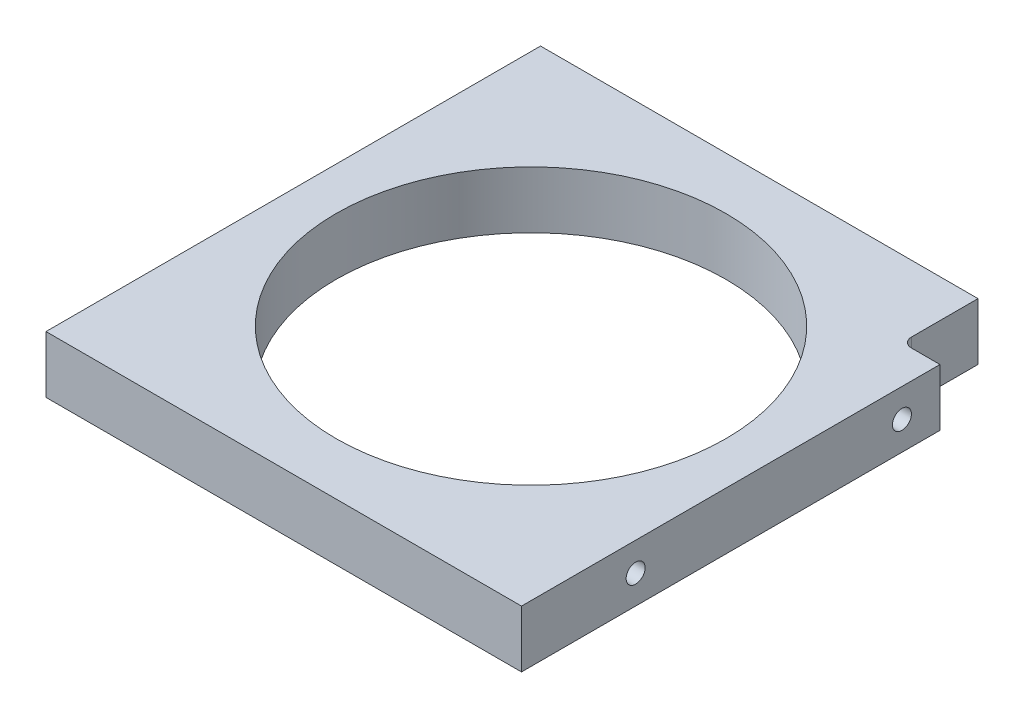
ISO-10303-21;
HEADER;
FILE_DESCRIPTION(('STEP AP214'),'2;1');
FILE_NAME('part.step','',(''),(''),'','','');
FILE_SCHEMA(('AUTOMOTIVE_DESIGN { 1 0 10303 214 1 1 1 1 }'));
ENDSEC;
DATA;
#1=APPLICATION_CONTEXT('core data for automotive mechanical design processes');
#2=APPLICATION_PROTOCOL_DEFINITION('international standard','automotive_design',2000,#1);
#3=PRODUCT_CONTEXT('',#1,'mechanical');
#4=PRODUCT('Part','Part','',(#3));
#5=PRODUCT_RELATED_PRODUCT_CATEGORY('part','',(#4));
#6=PRODUCT_DEFINITION_FORMATION('','',#4);
#7=PRODUCT_DEFINITION_CONTEXT('part definition',#1,'design');
#8=PRODUCT_DEFINITION('design','',#6,#7);
#9=PRODUCT_DEFINITION_SHAPE('','',#8);
#10=(LENGTH_UNIT() NAMED_UNIT(*) SI_UNIT(.MILLI.,.METRE.));
#11=(NAMED_UNIT(*) PLANE_ANGLE_UNIT() SI_UNIT($,.RADIAN.));
#12=(NAMED_UNIT(*) SI_UNIT($,.STERADIAN.) SOLID_ANGLE_UNIT());
#13=UNCERTAINTY_MEASURE_WITH_UNIT(LENGTH_MEASURE(1.E-05),#10,'distance_accuracy_value','');
#14=(GEOMETRIC_REPRESENTATION_CONTEXT(3) GLOBAL_UNCERTAINTY_ASSIGNED_CONTEXT((#13)) GLOBAL_UNIT_ASSIGNED_CONTEXT((#10,
#11,#12)) REPRESENTATION_CONTEXT('',''));
#15=CARTESIAN_POINT('',(0.,0.,0.));
#16=DIRECTION('',(0.,0.,1.));
#17=DIRECTION('',(1.,0.,0.));
#18=AXIS2_PLACEMENT_3D('',#15,#16,#17);
#19=CARTESIAN_POINT('',(0.,4.7625,0.));
#20=DIRECTION('',(0.,1.,0.));
#21=DIRECTION('',(0.,0.,1.));
#22=AXIS2_PLACEMENT_3D('',#19,#20,#21);
#23=PLANE('',#22);
#24=CARTESIAN_POINT('',(0.,4.7625,0.));
#25=DIRECTION('',(0.,1.,0.));
#26=DIRECTION('',(0.,0.,1.));
#27=AXIS2_PLACEMENT_3D('',#24,#25,#26);
#28=CIRCLE('',#27,32.54375);
#29=CARTESIAN_POINT('',(0.,4.7625,32.54375));
#30=VERTEX_POINT('',#29);
#31=EDGE_CURVE('E170',#30,#30,#28,.T.);
#32=ORIENTED_EDGE('',*,*,#31,.F.);
#33=EDGE_LOOP('',(#32));
#34=FACE_BOUND('',#33,.T.);
#35=DIRECTION('',(0.,0.,-1.));
#36=VECTOR('',#35,1.);
#37=CARTESIAN_POINT('',(39.6875,4.7625,41.275));
#38=LINE('',#37,#36);
#39=CARTESIAN_POINT('',(39.6875,4.7625,41.275));
#40=VERTEX_POINT('',#39);
#41=CARTESIAN_POINT('',(39.6875,4.7625,-28.575));
#42=VERTEX_POINT('',#41);
#43=EDGE_CURVE('E139',#40,#42,#38,.T.);
#44=ORIENTED_EDGE('',*,*,#43,.T.);
#45=DIRECTION('',(-1.,0.,0.));
#46=VECTOR('',#45,1.);
#47=CARTESIAN_POINT('',(39.6875,4.7625,-28.575));
#48=LINE('',#47,#46);
#49=CARTESIAN_POINT('',(34.925,4.7625,-28.575));
#50=VERTEX_POINT('',#49);
#51=EDGE_CURVE('E99',#42,#50,#48,.T.);
#52=ORIENTED_EDGE('',*,*,#51,.T.);
#53=CARTESIAN_POINT('',(34.925,4.7625,-30.1625));
#54=DIRECTION('',(0.,1.,0.));
#55=DIRECTION('',(0.,0.,1.));
#56=AXIS2_PLACEMENT_3D('',#53,#54,#55);
#57=CIRCLE('',#56,1.5875);
#58=CARTESIAN_POINT('',(33.3375,4.7625,-30.1625));
#59=VERTEX_POINT('',#58);
#60=EDGE_CURVE('E44',#50,#59,#57,.F.);
#61=ORIENTED_EDGE('',*,*,#60,.T.);
#62=DIRECTION('',(0.,0.,-1.));
#63=VECTOR('',#62,1.);
#64=CARTESIAN_POINT('',(33.3375,4.7625,-41.275));
#65=LINE('',#64,#63);
#66=CARTESIAN_POINT('',(33.3375,4.7625,-41.275));
#67=VERTEX_POINT('',#66);
#68=EDGE_CURVE('E113',#59,#67,#65,.T.);
#69=ORIENTED_EDGE('',*,*,#68,.T.);
#70=DIRECTION('',(-1.,0.,0.));
#71=VECTOR('',#70,1.);
#72=CARTESIAN_POINT('',(39.6875,4.7625,-41.275));
#73=LINE('',#72,#71);
#74=CARTESIAN_POINT('',(-39.6875,4.7625,-41.275));
#75=VERTEX_POINT('',#74);
#76=EDGE_CURVE('E131',#67,#75,#73,.T.);
#77=ORIENTED_EDGE('',*,*,#76,.T.);
#78=DIRECTION('',(0.,0.,1.));
#79=VECTOR('',#78,1.);
#80=CARTESIAN_POINT('',(-39.6875,4.7625,41.275));
#81=LINE('',#80,#79);
#82=CARTESIAN_POINT('',(-39.6875,4.7625,41.275));
#83=VERTEX_POINT('',#82);
#84=EDGE_CURVE('E122',#75,#83,#81,.T.);
#85=ORIENTED_EDGE('',*,*,#84,.T.);
#86=DIRECTION('',(1.,0.,0.));
#87=VECTOR('',#86,1.);
#88=CARTESIAN_POINT('',(39.6875,4.7625,41.275));
#89=LINE('',#88,#87);
#90=EDGE_CURVE('E177',#83,#40,#89,.T.);
#91=ORIENTED_EDGE('',*,*,#90,.T.);
#92=EDGE_LOOP('',(#44,#52,#61,#69,#77,#85,#91));
#93=FACE_BOUND('',#92,.T.);
#94=ADVANCED_FACE('F36',(#34,#93),#23,.T.);
#95=CARTESIAN_POINT('',(0.,-4.7625,0.));
#96=DIRECTION('',(0.,1.,0.));
#97=DIRECTION('',(0.,0.,1.));
#98=AXIS2_PLACEMENT_3D('',#95,#96,#97);
#99=PLANE('',#98);
#100=CARTESIAN_POINT('',(0.,-4.7625,0.));
#101=DIRECTION('',(0.,1.,0.));
#102=DIRECTION('',(0.,0.,1.));
#103=AXIS2_PLACEMENT_3D('',#100,#101,#102);
#104=CIRCLE('',#103,32.54375);
#105=CARTESIAN_POINT('',(0.,-4.7625,32.54375));
#106=VERTEX_POINT('',#105);
#107=EDGE_CURVE('E167',#106,#106,#104,.T.);
#108=ORIENTED_EDGE('',*,*,#107,.T.);
#109=EDGE_LOOP('',(#108));
#110=FACE_BOUND('',#109,.T.);
#111=DIRECTION('',(-1.,0.,0.));
#112=VECTOR('',#111,1.);
#113=CARTESIAN_POINT('',(39.6875,-4.7625,-28.575));
#114=LINE('',#113,#112);
#115=CARTESIAN_POINT('',(39.6875,-4.7625,-28.575));
#116=VERTEX_POINT('',#115);
#117=CARTESIAN_POINT('',(34.925,-4.7625,-28.575));
#118=VERTEX_POINT('',#117);
#119=EDGE_CURVE('E97',#116,#118,#114,.T.);
#120=ORIENTED_EDGE('',*,*,#119,.F.);
#121=DIRECTION('',(0.,0.,-1.));
#122=VECTOR('',#121,1.);
#123=CARTESIAN_POINT('',(39.6875,-4.7625,41.275));
#124=LINE('',#123,#122);
#125=CARTESIAN_POINT('',(39.6875,-4.7625,41.275));
#126=VERTEX_POINT('',#125);
#127=EDGE_CURVE('E110',#126,#116,#124,.T.);
#128=ORIENTED_EDGE('',*,*,#127,.F.);
#129=DIRECTION('',(1.,0.,0.));
#130=VECTOR('',#129,1.);
#131=CARTESIAN_POINT('',(39.6875,-4.7625,41.275));
#132=LINE('',#131,#130);
#133=CARTESIAN_POINT('',(-39.6875,-4.7625,41.275));
#134=VERTEX_POINT('',#133);
#135=EDGE_CURVE('E120',#134,#126,#132,.T.);
#136=ORIENTED_EDGE('',*,*,#135,.F.);
#137=DIRECTION('',(0.,0.,1.));
#138=VECTOR('',#137,1.);
#139=CARTESIAN_POINT('',(-39.6875,-4.7625,41.275));
#140=LINE('',#139,#138);
#141=CARTESIAN_POINT('',(-39.6875,-4.7625,-41.275));
#142=VERTEX_POINT('',#141);
#143=EDGE_CURVE('E124',#142,#134,#140,.T.);
#144=ORIENTED_EDGE('',*,*,#143,.F.);
#145=DIRECTION('',(-1.,0.,0.));
#146=VECTOR('',#145,1.);
#147=CARTESIAN_POINT('',(39.6875,-4.7625,-41.275));
#148=LINE('',#147,#146);
#149=CARTESIAN_POINT('',(33.3375,-4.7625,-41.275));
#150=VERTEX_POINT('',#149);
#151=EDGE_CURVE('E119',#150,#142,#148,.T.);
#152=ORIENTED_EDGE('',*,*,#151,.F.);
#153=DIRECTION('',(0.,0.,-1.));
#154=VECTOR('',#153,1.);
#155=CARTESIAN_POINT('',(33.3375,-4.7625,-41.275));
#156=LINE('',#155,#154);
#157=CARTESIAN_POINT('',(33.3375,-4.7625,-30.1625));
#158=VERTEX_POINT('',#157);
#159=EDGE_CURVE('E112',#158,#150,#156,.T.);
#160=ORIENTED_EDGE('',*,*,#159,.F.);
#161=CARTESIAN_POINT('',(34.925,-4.7625,-30.1625));
#162=DIRECTION('',(0.,1.,0.));
#163=DIRECTION('',(0.,0.,1.));
#164=AXIS2_PLACEMENT_3D('',#161,#162,#163);
#165=CIRCLE('',#164,1.5875);
#166=EDGE_CURVE('E11',#158,#118,#165,.T.);
#167=ORIENTED_EDGE('',*,*,#166,.T.);
#168=EDGE_LOOP('',(#120,#128,#136,#144,#152,#160,#167));
#169=FACE_BOUND('',#168,.T.);
#170=ADVANCED_FACE('F109',(#110,#169),#99,.F.);
#171=CARTESIAN_POINT('',(39.6875,4.7625,41.275));
#172=DIRECTION('',(-1.,0.,0.));
#173=DIRECTION('',(0.,0.,1.));
#174=AXIS2_PLACEMENT_3D('',#171,#172,#173);
#175=PLANE('',#174);
#176=CARTESIAN_POINT('',(39.6875,0.,-22.225));
#177=DIRECTION('',(-1.,0.,0.));
#178=DIRECTION('',(0.,0.,1.));
#179=AXIS2_PLACEMENT_3D('',#176,#177,#178);
#180=CIRCLE('',#179,1.5875);
#181=CARTESIAN_POINT('',(39.6875,0.,-20.6375));
#182=VERTEX_POINT('',#181);
#183=EDGE_CURVE('E149',#182,#182,#180,.T.);
#184=ORIENTED_EDGE('',*,*,#183,.T.);
#185=EDGE_LOOP('',(#184));
#186=FACE_BOUND('',#185,.T.);
#187=CARTESIAN_POINT('',(39.6875,0.,22.225));
#188=DIRECTION('',(-1.,0.,0.));
#189=DIRECTION('',(0.,0.,1.));
#190=AXIS2_PLACEMENT_3D('',#187,#188,#189);
#191=CIRCLE('',#190,1.5875);
#192=CARTESIAN_POINT('',(39.6875,0.,23.8125));
#193=VERTEX_POINT('',#192);
#194=EDGE_CURVE('E104',#193,#193,#191,.T.);
#195=ORIENTED_EDGE('',*,*,#194,.T.);
#196=EDGE_LOOP('',(#195));
#197=FACE_BOUND('',#196,.T.);
#198=DIRECTION('',(0.,1.,0.));
#199=VECTOR('',#198,1.);
#200=CARTESIAN_POINT('',(39.6875,-4.7625,-28.575));
#201=LINE('',#200,#199);
#202=EDGE_CURVE('E93',#116,#42,#201,.T.);
#203=ORIENTED_EDGE('',*,*,#202,.T.);
#204=ORIENTED_EDGE('',*,*,#43,.F.);
#205=DIRECTION('',(0.,-1.,0.));
#206=VECTOR('',#205,1.);
#207=CARTESIAN_POINT('',(39.6875,4.7625,41.275));
#208=LINE('',#207,#206);
#209=EDGE_CURVE('E118',#40,#126,#208,.T.);
#210=ORIENTED_EDGE('',*,*,#209,.T.);
#211=ORIENTED_EDGE('',*,*,#127,.T.);
#212=EDGE_LOOP('',(#203,#204,#210,#211));
#213=FACE_BOUND('',#212,.T.);
#214=ADVANCED_FACE('F116',(#186,#197,#213),#175,.F.);
#215=CARTESIAN_POINT('',(39.6875,4.7625,-41.275));
#216=DIRECTION('',(0.,0.,1.));
#217=DIRECTION('',(1.,0.,0.));
#218=AXIS2_PLACEMENT_3D('',#215,#216,#217);
#219=PLANE('',#218);
#220=DIRECTION('',(0.,1.,0.));
#221=VECTOR('',#220,1.);
#222=CARTESIAN_POINT('',(33.3375,-4.7625,-41.275));
#223=LINE('',#222,#221);
#224=EDGE_CURVE('E105',#150,#67,#223,.T.);
#225=ORIENTED_EDGE('',*,*,#224,.F.);
#226=ORIENTED_EDGE('',*,*,#151,.T.);
#227=DIRECTION('',(0.,-1.,0.));
#228=VECTOR('',#227,1.);
#229=CARTESIAN_POINT('',(-39.6875,4.7625,-41.275));
#230=LINE('',#229,#228);
#231=EDGE_CURVE('E128',#75,#142,#230,.T.);
#232=ORIENTED_EDGE('',*,*,#231,.F.);
#233=ORIENTED_EDGE('',*,*,#76,.F.);
#234=EDGE_LOOP('',(#225,#226,#232,#233));
#235=FACE_BOUND('',#234,.T.);
#236=ADVANCED_FACE('F193',(#235),#219,.F.);
#237=CARTESIAN_POINT('',(-39.6875,4.7625,41.275));
#238=DIRECTION('',(1.,0.,0.));
#239=DIRECTION('',(0.,0.,-1.));
#240=AXIS2_PLACEMENT_3D('',#237,#238,#239);
#241=PLANE('',#240);
#242=CARTESIAN_POINT('',(-39.6875,0.,22.225));
#243=DIRECTION('',(-1.,0.,0.));
#244=DIRECTION('',(0.,0.,1.));
#245=AXIS2_PLACEMENT_3D('',#242,#243,#244);
#246=CIRCLE('',#245,1.5875);
#247=CARTESIAN_POINT('',(-39.6875,0.,23.8125));
#248=VERTEX_POINT('',#247);
#249=EDGE_CURVE('E155',#248,#248,#246,.T.);
#250=ORIENTED_EDGE('',*,*,#249,.F.);
#251=EDGE_LOOP('',(#250));
#252=FACE_BOUND('',#251,.T.);
#253=CARTESIAN_POINT('',(-39.6875,0.,-22.225));
#254=DIRECTION('',(-1.,0.,0.));
#255=DIRECTION('',(0.,0.,1.));
#256=AXIS2_PLACEMENT_3D('',#253,#254,#255);
#257=CIRCLE('',#256,1.5875);
#258=CARTESIAN_POINT('',(-39.6875,0.,-20.6375));
#259=VERTEX_POINT('',#258);
#260=EDGE_CURVE('E161',#259,#259,#257,.T.);
#261=ORIENTED_EDGE('',*,*,#260,.F.);
#262=EDGE_LOOP('',(#261));
#263=FACE_BOUND('',#262,.T.);
#264=ORIENTED_EDGE('',*,*,#143,.T.);
#265=DIRECTION('',(0.,-1.,0.));
#266=VECTOR('',#265,1.);
#267=CARTESIAN_POINT('',(-39.6875,4.7625,41.275));
#268=LINE('',#267,#266);
#269=EDGE_CURVE('E133',#83,#134,#268,.T.);
#270=ORIENTED_EDGE('',*,*,#269,.F.);
#271=ORIENTED_EDGE('',*,*,#84,.F.);
#272=ORIENTED_EDGE('',*,*,#231,.T.);
#273=EDGE_LOOP('',(#264,#270,#271,#272));
#274=FACE_BOUND('',#273,.T.);
#275=ADVANCED_FACE('F184',(#252,#263,#274),#241,.F.);
#276=CARTESIAN_POINT('',(39.6875,4.7625,41.275));
#277=DIRECTION('',(0.,0.,-1.));
#278=DIRECTION('',(-1.,0.,0.));
#279=AXIS2_PLACEMENT_3D('',#276,#277,#278);
#280=PLANE('',#279);
#281=ORIENTED_EDGE('',*,*,#135,.T.);
#282=ORIENTED_EDGE('',*,*,#209,.F.);
#283=ORIENTED_EDGE('',*,*,#90,.F.);
#284=ORIENTED_EDGE('',*,*,#269,.T.);
#285=EDGE_LOOP('',(#281,#282,#283,#284));
#286=FACE_BOUND('',#285,.T.);
#287=ADVANCED_FACE('F189',(#286),#280,.F.);
#288=CARTESIAN_POINT('',(0.,4.7625,0.));
#289=DIRECTION('',(0.,-1.,0.));
#290=DIRECTION('',(0.,0.,-1.));
#291=AXIS2_PLACEMENT_3D('',#288,#289,#290);
#292=CYLINDRICAL_SURFACE('',#291,32.54375);
#293=ORIENTED_EDGE('',*,*,#31,.T.);
#294=EDGE_LOOP('',(#293));
#295=FACE_BOUND('',#294,.T.);
#296=ORIENTED_EDGE('',*,*,#107,.F.);
#297=EDGE_LOOP('',(#296));
#298=FACE_BOUND('',#297,.T.);
#299=ADVANCED_FACE('F210',(#295,#298),#292,.F.);
#300=CARTESIAN_POINT('',(-26.9875,0.,-22.225));
#301=DIRECTION('',(-1.,0.,0.));
#302=DIRECTION('',(0.,0.,1.));
#303=AXIS2_PLACEMENT_3D('',#300,#301,#302);
#304=CYLINDRICAL_SURFACE('',#303,1.5875);
#305=CARTESIAN_POINT('',(-26.9875,0.,-22.225));
#306=DIRECTION('',(-1.,0.,0.));
#307=DIRECTION('',(0.,0.,1.));
#308=AXIS2_PLACEMENT_3D('',#305,#306,#307);
#309=CIRCLE('',#308,1.5875);
#310=CARTESIAN_POINT('',(-26.9875,0.,-20.6375));
#311=VERTEX_POINT('',#310);
#312=EDGE_CURVE('E164',#311,#311,#309,.T.);
#313=ORIENTED_EDGE('',*,*,#312,.F.);
#314=EDGE_LOOP('',(#313));
#315=FACE_BOUND('',#314,.T.);
#316=ORIENTED_EDGE('',*,*,#260,.T.);
#317=EDGE_LOOP('',(#316));
#318=FACE_BOUND('',#317,.T.);
#319=ADVANCED_FACE('F227',(#315,#318),#304,.F.);
#320=CARTESIAN_POINT('',(-26.9875,0.,-22.225));
#321=DIRECTION('',(-1.,0.,0.));
#322=DIRECTION('',(0.,0.,1.));
#323=AXIS2_PLACEMENT_3D('',#320,#321,#322);
#324=PLANE('',#323);
#325=ORIENTED_EDGE('',*,*,#312,.T.);
#326=EDGE_LOOP('',(#325));
#327=FACE_BOUND('',#326,.T.);
#328=ADVANCED_FACE('F229',(#327),#324,.T.);
#329=CARTESIAN_POINT('',(-26.9875,0.,22.225));
#330=DIRECTION('',(-1.,0.,0.));
#331=DIRECTION('',(0.,0.,1.));
#332=AXIS2_PLACEMENT_3D('',#329,#330,#331);
#333=CYLINDRICAL_SURFACE('',#332,1.5875);
#334=CARTESIAN_POINT('',(-26.9875,0.,22.225));
#335=DIRECTION('',(-1.,0.,0.));
#336=DIRECTION('',(0.,0.,1.));
#337=AXIS2_PLACEMENT_3D('',#334,#335,#336);
#338=CIRCLE('',#337,1.5875);
#339=CARTESIAN_POINT('',(-26.9875,0.,23.8125));
#340=VERTEX_POINT('',#339);
#341=EDGE_CURVE('E158',#340,#340,#338,.T.);
#342=ORIENTED_EDGE('',*,*,#341,.F.);
#343=EDGE_LOOP('',(#342));
#344=FACE_BOUND('',#343,.T.);
#345=ORIENTED_EDGE('',*,*,#249,.T.);
#346=EDGE_LOOP('',(#345));
#347=FACE_BOUND('',#346,.T.);
#348=ADVANCED_FACE('F235',(#344,#347),#333,.F.);
#349=CARTESIAN_POINT('',(-26.9875,0.,22.225));
#350=DIRECTION('',(-1.,0.,0.));
#351=DIRECTION('',(0.,0.,1.));
#352=AXIS2_PLACEMENT_3D('',#349,#350,#351);
#353=PLANE('',#352);
#354=ORIENTED_EDGE('',*,*,#341,.T.);
#355=EDGE_LOOP('',(#354));
#356=FACE_BOUND('',#355,.T.);
#357=ADVANCED_FACE('F243',(#356),#353,.T.);
#358=CARTESIAN_POINT('',(26.9875,0.,-22.225));
#359=DIRECTION('',(1.,0.,0.));
#360=DIRECTION('',(0.,0.,-1.));
#361=AXIS2_PLACEMENT_3D('',#358,#359,#360);
#362=CYLINDRICAL_SURFACE('',#361,1.5875);
#363=CARTESIAN_POINT('',(26.9875,0.,-22.225));
#364=DIRECTION('',(-1.,0.,0.));
#365=DIRECTION('',(0.,0.,1.));
#366=AXIS2_PLACEMENT_3D('',#363,#364,#365);
#367=CIRCLE('',#366,1.5875);
#368=CARTESIAN_POINT('',(26.9875,0.,-20.6375));
#369=VERTEX_POINT('',#368);
#370=EDGE_CURVE('E152',#369,#369,#367,.T.);
#371=ORIENTED_EDGE('',*,*,#370,.T.);
#372=EDGE_LOOP('',(#371));
#373=FACE_BOUND('',#372,.T.);
#374=ORIENTED_EDGE('',*,*,#183,.F.);
#375=EDGE_LOOP('',(#374));
#376=FACE_BOUND('',#375,.T.);
#377=ADVANCED_FACE('F247',(#373,#376),#362,.F.);
#378=CARTESIAN_POINT('',(26.9875,0.,-22.225));
#379=DIRECTION('',(1.,0.,0.));
#380=DIRECTION('',(0.,0.,1.));
#381=AXIS2_PLACEMENT_3D('',#378,#379,#380);
#382=PLANE('',#381);
#383=ORIENTED_EDGE('',*,*,#370,.F.);
#384=EDGE_LOOP('',(#383));
#385=FACE_BOUND('',#384,.T.);
#386=ADVANCED_FACE('F251',(#385),#382,.T.);
#387=CARTESIAN_POINT('',(26.9875,0.,22.225));
#388=DIRECTION('',(1.,0.,0.));
#389=DIRECTION('',(0.,0.,-1.));
#390=AXIS2_PLACEMENT_3D('',#387,#388,#389);
#391=CYLINDRICAL_SURFACE('',#390,1.5875);
#392=CARTESIAN_POINT('',(26.9875,0.,22.225));
#393=DIRECTION('',(-1.,0.,0.));
#394=DIRECTION('',(0.,0.,1.));
#395=AXIS2_PLACEMENT_3D('',#392,#393,#394);
#396=CIRCLE('',#395,1.5875);
#397=CARTESIAN_POINT('',(26.9875,0.,23.8125));
#398=VERTEX_POINT('',#397);
#399=EDGE_CURVE('E146',#398,#398,#396,.T.);
#400=ORIENTED_EDGE('',*,*,#399,.T.);
#401=EDGE_LOOP('',(#400));
#402=FACE_BOUND('',#401,.T.);
#403=ORIENTED_EDGE('',*,*,#194,.F.);
#404=EDGE_LOOP('',(#403));
#405=FACE_BOUND('',#404,.T.);
#406=ADVANCED_FACE('F255',(#402,#405),#391,.F.);
#407=CARTESIAN_POINT('',(26.9875,0.,22.225));
#408=DIRECTION('',(1.,0.,0.));
#409=DIRECTION('',(0.,0.,1.));
#410=AXIS2_PLACEMENT_3D('',#407,#408,#409);
#411=PLANE('',#410);
#412=ORIENTED_EDGE('',*,*,#399,.F.);
#413=EDGE_LOOP('',(#412));
#414=FACE_BOUND('',#413,.T.);
#415=ADVANCED_FACE('F259',(#414),#411,.T.);
#416=CARTESIAN_POINT('',(39.6875,-4.7625,-28.575));
#417=DIRECTION('',(0.,0.,-1.));
#418=DIRECTION('',(-1.,0.,0.));
#419=AXIS2_PLACEMENT_3D('',#416,#417,#418);
#420=PLANE('',#419);
#421=ORIENTED_EDGE('',*,*,#119,.T.);
#422=DIRECTION('',(0.,1.,0.));
#423=VECTOR('',#422,1.);
#424=CARTESIAN_POINT('',(34.925,4.7625,-28.575));
#425=LINE('',#424,#423);
#426=EDGE_CURVE('E136',#118,#50,#425,.T.);
#427=ORIENTED_EDGE('',*,*,#426,.T.);
#428=ORIENTED_EDGE('',*,*,#51,.F.);
#429=ORIENTED_EDGE('',*,*,#202,.F.);
#430=EDGE_LOOP('',(#421,#427,#428,#429));
#431=FACE_BOUND('',#430,.T.);
#432=ADVANCED_FACE('F95',(#431),#420,.T.);
#433=CARTESIAN_POINT('',(33.3375,-4.7625,-41.275));
#434=DIRECTION('',(1.,0.,0.));
#435=DIRECTION('',(0.,0.,-1.));
#436=AXIS2_PLACEMENT_3D('',#433,#434,#435);
#437=PLANE('',#436);
#438=ORIENTED_EDGE('',*,*,#68,.F.);
#439=DIRECTION('',(0.,1.,0.));
#440=VECTOR('',#439,1.);
#441=CARTESIAN_POINT('',(33.3375,-4.7625,-30.1625));
#442=LINE('',#441,#440);
#443=EDGE_CURVE('E51',#59,#158,#442,.F.);
#444=ORIENTED_EDGE('',*,*,#443,.T.);
#445=ORIENTED_EDGE('',*,*,#159,.T.);
#446=ORIENTED_EDGE('',*,*,#224,.T.);
#447=EDGE_LOOP('',(#438,#444,#445,#446));
#448=FACE_BOUND('',#447,.T.);
#449=ADVANCED_FACE('F194',(#448),#437,.T.);
#450=CARTESIAN_POINT('',(34.925,-4.7625,-30.1625));
#451=DIRECTION('',(0.,-1.,0.));
#452=DIRECTION('',(0.,0.,-1.));
#453=AXIS2_PLACEMENT_3D('',#450,#451,#452);
#454=CYLINDRICAL_SURFACE('',#453,1.5875);
#455=ORIENTED_EDGE('',*,*,#166,.F.);
#456=ORIENTED_EDGE('',*,*,#443,.F.);
#457=ORIENTED_EDGE('',*,*,#60,.F.);
#458=ORIENTED_EDGE('',*,*,#426,.F.);
#459=EDGE_LOOP('',(#455,#456,#457,#458));
#460=FACE_BOUND('',#459,.T.);
#461=ADVANCED_FACE('F38',(#460),#454,.F.);
#462=CLOSED_SHELL('',(#94,#170,#214,#236,#275,#287,#299,#319,#328,#348,#357,#377,#386,#406,#415,
#432,#449,#461));
#463=MANIFOLD_SOLID_BREP('B2',#462);
#464=ADVANCED_BREP_SHAPE_REPRESENTATION('',(#18,#463),#14);
#465=SHAPE_DEFINITION_REPRESENTATION(#9,#464);
ENDSEC;
END-ISO-10303-21;
